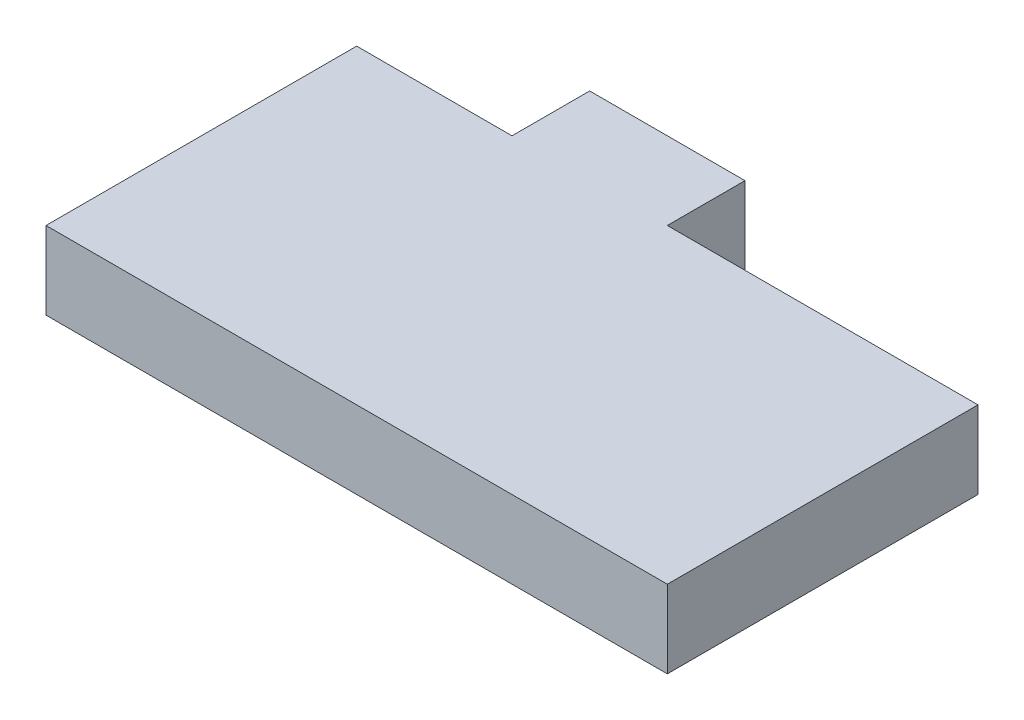
ISO-10303-21;
HEADER;
FILE_DESCRIPTION(('STEP AP214'),'2;1');
FILE_NAME('part.step','',(''),(''),'','','');
FILE_SCHEMA(('AUTOMOTIVE_DESIGN { 1 0 10303 214 1 1 1 1 }'));
ENDSEC;
DATA;
#1=APPLICATION_CONTEXT('core data for automotive mechanical design processes');
#2=APPLICATION_PROTOCOL_DEFINITION('international standard','automotive_design',2000,#1);
#3=PRODUCT_CONTEXT('',#1,'mechanical');
#4=PRODUCT('Part','Part','',(#3));
#5=PRODUCT_RELATED_PRODUCT_CATEGORY('part','',(#4));
#6=PRODUCT_DEFINITION_FORMATION('','',#4);
#7=PRODUCT_DEFINITION_CONTEXT('part definition',#1,'design');
#8=PRODUCT_DEFINITION('design','',#6,#7);
#9=PRODUCT_DEFINITION_SHAPE('','',#8);
#10=(LENGTH_UNIT() NAMED_UNIT(*) SI_UNIT(.MILLI.,.METRE.));
#11=(NAMED_UNIT(*) PLANE_ANGLE_UNIT() SI_UNIT($,.RADIAN.));
#12=(NAMED_UNIT(*) SI_UNIT($,.STERADIAN.) SOLID_ANGLE_UNIT());
#13=UNCERTAINTY_MEASURE_WITH_UNIT(LENGTH_MEASURE(1.E-05),#10,'distance_accuracy_value','');
#14=(GEOMETRIC_REPRESENTATION_CONTEXT(3) GLOBAL_UNCERTAINTY_ASSIGNED_CONTEXT((#13)) GLOBAL_UNIT_ASSIGNED_CONTEXT((#10,
#11,#12)) REPRESENTATION_CONTEXT('',''));
#15=CARTESIAN_POINT('',(0.,0.,0.));
#16=DIRECTION('',(0.,0.,1.));
#17=DIRECTION('',(1.,0.,0.));
#18=AXIS2_PLACEMENT_3D('',#15,#16,#17);
#19=CARTESIAN_POINT('',(25.4,6.35,0.));
#20=DIRECTION('',(1.,0.,0.));
#21=DIRECTION('',(0.,0.,1.));
#22=AXIS2_PLACEMENT_3D('',#19,#20,#21);
#23=PLANE('',#22);
#24=DIRECTION('',(0.,0.,-1.));
#25=VECTOR('',#24,1.);
#26=CARTESIAN_POINT('',(25.4,0.,0.));
#27=LINE('',#26,#25);
#28=CARTESIAN_POINT('',(25.4,0.,0.));
#29=VERTEX_POINT('',#28);
#30=CARTESIAN_POINT('',(25.4,0.,-6.35));
#31=VERTEX_POINT('',#30);
#32=EDGE_CURVE('E160',#29,#31,#27,.T.);
#33=ORIENTED_EDGE('',*,*,#32,.T.);
#34=DIRECTION('',(0.,-1.,0.));
#35=VECTOR('',#34,1.);
#36=CARTESIAN_POINT('',(25.4,6.35,-6.35));
#37=LINE('',#36,#35);
#38=CARTESIAN_POINT('',(25.4,6.35,-6.35));
#39=VERTEX_POINT('',#38);
#40=EDGE_CURVE('E141',#39,#31,#37,.T.);
#41=ORIENTED_EDGE('',*,*,#40,.F.);
#42=DIRECTION('',(0.,0.,-1.));
#43=VECTOR('',#42,1.);
#44=CARTESIAN_POINT('',(25.4,6.35,0.));
#45=LINE('',#44,#43);
#46=CARTESIAN_POINT('',(25.4,6.35,0.));
#47=VERTEX_POINT('',#46);
#48=EDGE_CURVE('E130',#47,#39,#45,.T.);
#49=ORIENTED_EDGE('',*,*,#48,.F.);
#50=DIRECTION('',(0.,-1.,0.));
#51=VECTOR('',#50,1.);
#52=CARTESIAN_POINT('',(25.4,6.35,0.));
#53=LINE('',#52,#51);
#54=EDGE_CURVE('E11',#47,#29,#53,.T.);
#55=ORIENTED_EDGE('',*,*,#54,.T.);
#56=EDGE_LOOP('',(#33,#41,#49,#55));
#57=FACE_BOUND('',#56,.T.);
#58=ADVANCED_FACE('F35',(#57),#23,.T.);
#59=CARTESIAN_POINT('',(0.,6.35,0.));
#60=DIRECTION('',(0.,0.,1.));
#61=DIRECTION('',(-1.,0.,0.));
#62=AXIS2_PLACEMENT_3D('',#59,#60,#61);
#63=PLANE('',#62);
#64=DIRECTION('',(1.,0.,0.));
#65=VECTOR('',#64,1.);
#66=CARTESIAN_POINT('',(0.,0.,0.));
#67=LINE('',#66,#65);
#68=CARTESIAN_POINT('',(50.8,0.,0.));
#69=VERTEX_POINT('',#68);
#70=EDGE_CURVE('E153',#29,#69,#67,.T.);
#71=ORIENTED_EDGE('',*,*,#70,.F.);
#72=ORIENTED_EDGE('',*,*,#54,.F.);
#73=DIRECTION('',(1.,0.,0.));
#74=VECTOR('',#73,1.);
#75=CARTESIAN_POINT('',(0.,6.35,0.));
#76=LINE('',#75,#74);
#77=CARTESIAN_POINT('',(50.8,6.35,0.));
#78=VERTEX_POINT('',#77);
#79=EDGE_CURVE('E89',#47,#78,#76,.T.);
#80=ORIENTED_EDGE('',*,*,#79,.T.);
#81=DIRECTION('',(0.,-1.,0.));
#82=VECTOR('',#81,1.);
#83=CARTESIAN_POINT('',(50.8,6.35,0.));
#84=LINE('',#83,#82);
#85=EDGE_CURVE('E43',#78,#69,#84,.T.);
#86=ORIENTED_EDGE('',*,*,#85,.T.);
#87=EDGE_LOOP('',(#71,#72,#80,#86));
#88=FACE_BOUND('',#87,.T.);
#89=ADVANCED_FACE('F152',(#88),#63,.F.);
#90=CARTESIAN_POINT('',(50.8,6.35,0.));
#91=DIRECTION('',(-1.,0.,0.));
#92=DIRECTION('',(0.,0.,-1.));
#93=AXIS2_PLACEMENT_3D('',#90,#91,#92);
#94=PLANE('',#93);
#95=DIRECTION('',(0.,0.,1.));
#96=VECTOR('',#95,1.);
#97=CARTESIAN_POINT('',(50.8,0.,0.));
#98=LINE('',#97,#96);
#99=CARTESIAN_POINT('',(50.8,0.,25.4));
#100=VERTEX_POINT('',#99);
#101=EDGE_CURVE('E158',#69,#100,#98,.T.);
#102=ORIENTED_EDGE('',*,*,#101,.F.);
#103=ORIENTED_EDGE('',*,*,#85,.F.);
#104=DIRECTION('',(0.,0.,1.));
#105=VECTOR('',#104,1.);
#106=CARTESIAN_POINT('',(50.8,6.35,0.));
#107=LINE('',#106,#105);
#108=CARTESIAN_POINT('',(50.8,6.35,25.4));
#109=VERTEX_POINT('',#108);
#110=EDGE_CURVE('E129',#78,#109,#107,.T.);
#111=ORIENTED_EDGE('',*,*,#110,.T.);
#112=DIRECTION('',(0.,-1.,0.));
#113=VECTOR('',#112,1.);
#114=CARTESIAN_POINT('',(50.8,6.35,25.4));
#115=LINE('',#114,#113);
#116=EDGE_CURVE('E148',#109,#100,#115,.T.);
#117=ORIENTED_EDGE('',*,*,#116,.T.);
#118=EDGE_LOOP('',(#102,#103,#111,#117));
#119=FACE_BOUND('',#118,.T.);
#120=ADVANCED_FACE('F174',(#119),#94,.F.);
#121=CARTESIAN_POINT('',(0.,6.35,25.4));
#122=DIRECTION('',(0.,0.,1.));
#123=DIRECTION('',(-1.,0.,0.));
#124=AXIS2_PLACEMENT_3D('',#121,#122,#123);
#125=PLANE('',#124);
#126=DIRECTION('',(1.,0.,0.));
#127=VECTOR('',#126,1.);
#128=CARTESIAN_POINT('',(0.,0.,25.4));
#129=LINE('',#128,#127);
#130=CARTESIAN_POINT('',(0.,0.,25.4));
#131=VERTEX_POINT('',#130);
#132=EDGE_CURVE('E162',#131,#100,#129,.T.);
#133=ORIENTED_EDGE('',*,*,#132,.T.);
#134=ORIENTED_EDGE('',*,*,#116,.F.);
#135=DIRECTION('',(1.,0.,0.));
#136=VECTOR('',#135,1.);
#137=CARTESIAN_POINT('',(0.,6.35,25.4));
#138=LINE('',#137,#136);
#139=CARTESIAN_POINT('',(0.,6.35,25.4));
#140=VERTEX_POINT('',#139);
#141=EDGE_CURVE('E125',#140,#109,#138,.T.);
#142=ORIENTED_EDGE('',*,*,#141,.F.);
#143=DIRECTION('',(0.,-1.,0.));
#144=VECTOR('',#143,1.);
#145=CARTESIAN_POINT('',(0.,6.35,25.4));
#146=LINE('',#145,#144);
#147=EDGE_CURVE('E145',#140,#131,#146,.T.);
#148=ORIENTED_EDGE('',*,*,#147,.T.);
#149=EDGE_LOOP('',(#133,#134,#142,#148));
#150=FACE_BOUND('',#149,.T.);
#151=ADVANCED_FACE('F172',(#150),#125,.T.);
#152=CARTESIAN_POINT('',(0.,6.35,0.));
#153=DIRECTION('',(-1.,0.,0.));
#154=DIRECTION('',(0.,0.,-1.));
#155=AXIS2_PLACEMENT_3D('',#152,#153,#154);
#156=PLANE('',#155);
#157=DIRECTION('',(0.,0.,1.));
#158=VECTOR('',#157,1.);
#159=CARTESIAN_POINT('',(0.,0.,0.));
#160=LINE('',#159,#158);
#161=CARTESIAN_POINT('',(0.,0.,0.));
#162=VERTEX_POINT('',#161);
#163=EDGE_CURVE('E165',#162,#131,#160,.T.);
#164=ORIENTED_EDGE('',*,*,#163,.T.);
#165=ORIENTED_EDGE('',*,*,#147,.F.);
#166=DIRECTION('',(0.,0.,1.));
#167=VECTOR('',#166,1.);
#168=CARTESIAN_POINT('',(0.,6.35,0.));
#169=LINE('',#168,#167);
#170=CARTESIAN_POINT('',(0.,6.35,0.));
#171=VERTEX_POINT('',#170);
#172=EDGE_CURVE('E123',#171,#140,#169,.T.);
#173=ORIENTED_EDGE('',*,*,#172,.F.);
#174=DIRECTION('',(0.,-1.,0.));
#175=VECTOR('',#174,1.);
#176=CARTESIAN_POINT('',(0.,6.35,0.));
#177=LINE('',#176,#175);
#178=EDGE_CURVE('E117',#171,#162,#177,.T.);
#179=ORIENTED_EDGE('',*,*,#178,.T.);
#180=EDGE_LOOP('',(#164,#165,#173,#179));
#181=FACE_BOUND('',#180,.T.);
#182=ADVANCED_FACE('F177',(#181),#156,.T.);
#183=CARTESIAN_POINT('',(12.7,0.,0.));
#184=VERTEX_POINT('',#183);
#185=EDGE_CURVE('E137',#162,#184,#67,.T.);
#186=ORIENTED_EDGE('',*,*,#185,.F.);
#187=ORIENTED_EDGE('',*,*,#178,.F.);
#188=CARTESIAN_POINT('',(12.7,6.35,0.));
#189=VERTEX_POINT('',#188);
#190=EDGE_CURVE('E107',#171,#189,#76,.T.);
#191=ORIENTED_EDGE('',*,*,#190,.T.);
#192=DIRECTION('',(0.,-1.,0.));
#193=VECTOR('',#192,1.);
#194=CARTESIAN_POINT('',(12.7,6.35,0.));
#195=LINE('',#194,#193);
#196=EDGE_CURVE('E112',#189,#184,#195,.T.);
#197=ORIENTED_EDGE('',*,*,#196,.T.);
#198=EDGE_LOOP('',(#186,#187,#191,#197));
#199=FACE_BOUND('',#198,.T.);
#200=ADVANCED_FACE('F120',(#199),#63,.F.);
#201=CARTESIAN_POINT('',(12.7,6.35,0.));
#202=DIRECTION('',(1.,0.,0.));
#203=DIRECTION('',(0.,0.,1.));
#204=AXIS2_PLACEMENT_3D('',#201,#202,#203);
#205=PLANE('',#204);
#206=DIRECTION('',(0.,0.,-1.));
#207=VECTOR('',#206,1.);
#208=CARTESIAN_POINT('',(12.7,0.,0.));
#209=LINE('',#208,#207);
#210=CARTESIAN_POINT('',(12.7,0.,-6.35));
#211=VERTEX_POINT('',#210);
#212=EDGE_CURVE('E114',#184,#211,#209,.T.);
#213=ORIENTED_EDGE('',*,*,#212,.F.);
#214=ORIENTED_EDGE('',*,*,#196,.F.);
#215=DIRECTION('',(0.,0.,-1.));
#216=VECTOR('',#215,1.);
#217=CARTESIAN_POINT('',(12.7,6.35,0.));
#218=LINE('',#217,#216);
#219=CARTESIAN_POINT('',(12.7,6.35,-6.35));
#220=VERTEX_POINT('',#219);
#221=EDGE_CURVE('E103',#189,#220,#218,.T.);
#222=ORIENTED_EDGE('',*,*,#221,.T.);
#223=DIRECTION('',(0.,-1.,0.));
#224=VECTOR('',#223,1.);
#225=CARTESIAN_POINT('',(12.7,6.35,-6.35));
#226=LINE('',#225,#224);
#227=EDGE_CURVE('E118',#220,#211,#226,.T.);
#228=ORIENTED_EDGE('',*,*,#227,.T.);
#229=EDGE_LOOP('',(#213,#214,#222,#228));
#230=FACE_BOUND('',#229,.T.);
#231=ADVANCED_FACE('F113',(#230),#205,.F.);
#232=CARTESIAN_POINT('',(0.,6.35,-6.35));
#233=DIRECTION('',(0.,0.,1.));
#234=DIRECTION('',(-1.,0.,0.));
#235=AXIS2_PLACEMENT_3D('',#232,#233,#234);
#236=PLANE('',#235);
#237=DIRECTION('',(1.,0.,0.));
#238=VECTOR('',#237,1.);
#239=CARTESIAN_POINT('',(0.,0.,-6.35));
#240=LINE('',#239,#238);
#241=EDGE_CURVE('E77',#211,#31,#240,.T.);
#242=ORIENTED_EDGE('',*,*,#241,.F.);
#243=ORIENTED_EDGE('',*,*,#227,.F.);
#244=DIRECTION('',(1.,0.,0.));
#245=VECTOR('',#244,1.);
#246=CARTESIAN_POINT('',(0.,6.35,-6.35));
#247=LINE('',#246,#245);
#248=EDGE_CURVE('E51',#220,#39,#247,.T.);
#249=ORIENTED_EDGE('',*,*,#248,.T.);
#250=ORIENTED_EDGE('',*,*,#40,.T.);
#251=EDGE_LOOP('',(#242,#243,#249,#250));
#252=FACE_BOUND('',#251,.T.);
#253=ADVANCED_FACE('F191',(#252),#236,.F.);
#254=CARTESIAN_POINT('',(0.,6.35,0.));
#255=DIRECTION('',(0.,1.,0.));
#256=DIRECTION('',(0.,0.,-1.));
#257=AXIS2_PLACEMENT_3D('',#254,#255,#256);
#258=PLANE('',#257);
#259=ORIENTED_EDGE('',*,*,#48,.T.);
#260=ORIENTED_EDGE('',*,*,#248,.F.);
#261=ORIENTED_EDGE('',*,*,#221,.F.);
#262=ORIENTED_EDGE('',*,*,#190,.F.);
#263=ORIENTED_EDGE('',*,*,#172,.T.);
#264=ORIENTED_EDGE('',*,*,#141,.T.);
#265=ORIENTED_EDGE('',*,*,#110,.F.);
#266=ORIENTED_EDGE('',*,*,#79,.F.);
#267=EDGE_LOOP('',(#259,#260,#261,#262,#263,#264,#265,#266));
#268=FACE_BOUND('',#267,.T.);
#269=ADVANCED_FACE('F105',(#268),#258,.T.);
#270=CARTESIAN_POINT('',(0.,0.,0.));
#271=DIRECTION('',(0.,1.,0.));
#272=DIRECTION('',(0.,0.,-1.));
#273=AXIS2_PLACEMENT_3D('',#270,#271,#272);
#274=PLANE('',#273);
#275=ORIENTED_EDGE('',*,*,#32,.F.);
#276=ORIENTED_EDGE('',*,*,#70,.T.);
#277=ORIENTED_EDGE('',*,*,#101,.T.);
#278=ORIENTED_EDGE('',*,*,#132,.F.);
#279=ORIENTED_EDGE('',*,*,#163,.F.);
#280=ORIENTED_EDGE('',*,*,#185,.T.);
#281=ORIENTED_EDGE('',*,*,#212,.T.);
#282=ORIENTED_EDGE('',*,*,#241,.T.);
#283=EDGE_LOOP('',(#275,#276,#277,#278,#279,#280,#281,#282));
#284=FACE_BOUND('',#283,.T.);
#285=ADVANCED_FACE('F156',(#284),#274,.F.);
#286=CLOSED_SHELL('',(#58,#89,#120,#151,#182,#200,#231,#253,#269,#285));
#287=MANIFOLD_SOLID_BREP('B2',#286);
#288=ADVANCED_BREP_SHAPE_REPRESENTATION('',(#18,#287),#14);
#289=SHAPE_DEFINITION_REPRESENTATION(#9,#288);
ENDSEC;
END-ISO-10303-21;
